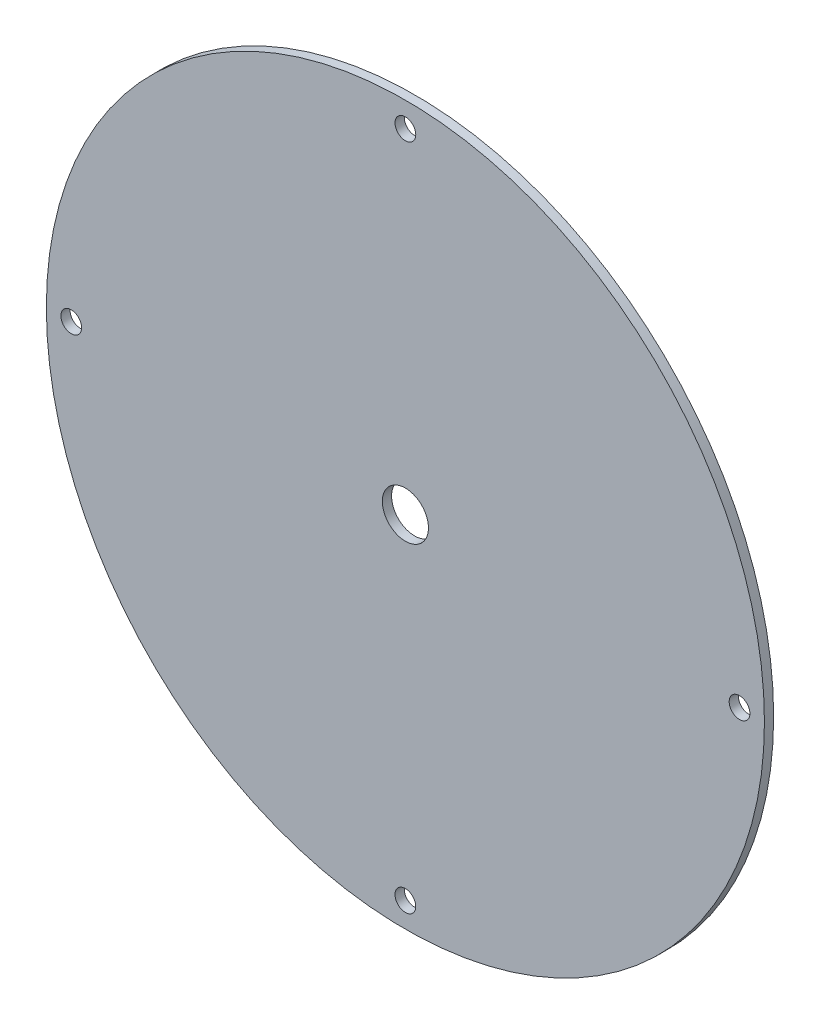
ISO-10303-21;
HEADER;
FILE_DESCRIPTION(('STEP AP214'),'2;1');
FILE_NAME('part.step','',(''),(''),'','','');
FILE_SCHEMA(('AUTOMOTIVE_DESIGN { 1 0 10303 214 1 1 1 1 }'));
ENDSEC;
DATA;
#1=APPLICATION_CONTEXT('core data for automotive mechanical design processes');
#2=APPLICATION_PROTOCOL_DEFINITION('international standard','automotive_design',2000,#1);
#3=PRODUCT_CONTEXT('',#1,'mechanical');
#4=PRODUCT('Part','Part','',(#3));
#5=PRODUCT_RELATED_PRODUCT_CATEGORY('part','',(#4));
#6=PRODUCT_DEFINITION_FORMATION('','',#4);
#7=PRODUCT_DEFINITION_CONTEXT('part definition',#1,'design');
#8=PRODUCT_DEFINITION('design','',#6,#7);
#9=PRODUCT_DEFINITION_SHAPE('','',#8);
#10=(LENGTH_UNIT() NAMED_UNIT(*) SI_UNIT(.MILLI.,.METRE.));
#11=(NAMED_UNIT(*) PLANE_ANGLE_UNIT() SI_UNIT($,.RADIAN.));
#12=(NAMED_UNIT(*) SI_UNIT($,.STERADIAN.) SOLID_ANGLE_UNIT());
#13=UNCERTAINTY_MEASURE_WITH_UNIT(LENGTH_MEASURE(1.E-05),#10,'distance_accuracy_value','');
#14=(GEOMETRIC_REPRESENTATION_CONTEXT(3) GLOBAL_UNCERTAINTY_ASSIGNED_CONTEXT((#13)) GLOBAL_UNIT_ASSIGNED_CONTEXT((#10,
#11,#12)) REPRESENTATION_CONTEXT('',''));
#15=CARTESIAN_POINT('',(0.,0.,0.));
#16=DIRECTION('',(0.,0.,1.));
#17=DIRECTION('',(1.,0.,0.));
#18=AXIS2_PLACEMENT_3D('',#15,#16,#17);
#19=CARTESIAN_POINT('',(0.0711207907724242,0.517607884922749,2.));
#20=DIRECTION('',(0.,0.,1.));
#21=DIRECTION('',(1.,0.,0.));
#22=AXIS2_PLACEMENT_3D('',#19,#20,#21);
#23=PLANE('',#22);
#24=CARTESIAN_POINT('',(-72.4288792092298,0.517607884925696,2.));
#25=DIRECTION('',(0.,0.,1.));
#26=DIRECTION('',(1.,0.,0.));
#27=AXIS2_PLACEMENT_3D('',#24,#25,#26);
#28=CIRCLE('',#27,2.25);
#29=CARTESIAN_POINT('',(-70.1788792092298,0.517607884925696,2.));
#30=VERTEX_POINT('',#29);
#31=EDGE_CURVE('E67',#30,#30,#28,.T.);
#32=ORIENTED_EDGE('',*,*,#31,.F.);
#33=EDGE_LOOP('',(#32));
#34=FACE_BOUND('',#33,.T.);
#35=CARTESIAN_POINT('',(72.5711207907702,0.517607884920295,2.));
#36=DIRECTION('',(0.,0.,1.));
#37=DIRECTION('',(1.,0.,0.));
#38=AXIS2_PLACEMENT_3D('',#35,#36,#37);
#39=CIRCLE('',#38,2.25);
#40=CARTESIAN_POINT('',(74.8211207907702,0.517607884920295,2.));
#41=VERTEX_POINT('',#40);
#42=EDGE_CURVE('E55',#41,#41,#39,.T.);
#43=ORIENTED_EDGE('',*,*,#42,.F.);
#44=EDGE_LOOP('',(#43));
#45=FACE_BOUND('',#44,.T.);
#46=CARTESIAN_POINT('',(0.0711207907724242,0.517607884922749,2.));
#47=DIRECTION('',(0.,0.,1.));
#48=DIRECTION('',(1.,0.,0.));
#49=AXIS2_PLACEMENT_3D('',#46,#47,#48);
#50=CIRCLE('',#49,77.9);
#51=CARTESIAN_POINT('',(77.9711207907724,0.517607884922749,2.));
#52=VERTEX_POINT('',#51);
#53=EDGE_CURVE('E10',#52,#52,#50,.T.);
#54=ORIENTED_EDGE('',*,*,#53,.T.);
#55=EDGE_LOOP('',(#54));
#56=FACE_BOUND('',#55,.T.);
#57=CARTESIAN_POINT('',(0.0711207907724082,73.0176078849227,2.));
#58=DIRECTION('',(0.,0.,1.));
#59=DIRECTION('',(1.,0.,0.));
#60=AXIS2_PLACEMENT_3D('',#57,#58,#59);
#61=CIRCLE('',#60,2.25);
#62=CARTESIAN_POINT('',(2.32112079077241,73.0176078849227,2.));
#63=VERTEX_POINT('',#62);
#64=EDGE_CURVE('E50',#63,#63,#61,.T.);
#65=ORIENTED_EDGE('',*,*,#64,.F.);
#66=EDGE_LOOP('',(#65));
#67=FACE_BOUND('',#66,.T.);
#68=CARTESIAN_POINT('',(0.0711207907674998,-71.9823921150772,2.));
#69=DIRECTION('',(0.,0.,1.));
#70=DIRECTION('',(1.,0.,0.));
#71=AXIS2_PLACEMENT_3D('',#68,#69,#70);
#72=CIRCLE('',#71,2.25);
#73=CARTESIAN_POINT('',(2.3211207907675,-71.9823921150772,2.));
#74=VERTEX_POINT('',#73);
#75=EDGE_CURVE('E61',#74,#74,#72,.T.);
#76=ORIENTED_EDGE('',*,*,#75,.F.);
#77=EDGE_LOOP('',(#76));
#78=FACE_BOUND('',#77,.T.);
#79=CARTESIAN_POINT('',(0.0711207907724242,0.517607884922749,2.));
#80=DIRECTION('',(0.,0.,1.));
#81=DIRECTION('',(1.,0.,0.));
#82=AXIS2_PLACEMENT_3D('',#79,#80,#81);
#83=CIRCLE('',#82,5.);
#84=CARTESIAN_POINT('',(5.07112079077242,0.517607884922749,2.));
#85=VERTEX_POINT('',#84);
#86=EDGE_CURVE('E73',#85,#85,#83,.T.);
#87=ORIENTED_EDGE('',*,*,#86,.F.);
#88=EDGE_LOOP('',(#87));
#89=FACE_BOUND('',#88,.T.);
#90=ADVANCED_FACE('F39',(#34,#45,#56,#67,#78,#89),#23,.T.);
#91=CARTESIAN_POINT('',(0.0711207907724242,0.517607884922749,0.));
#92=DIRECTION('',(0.,0.,1.));
#93=DIRECTION('',(1.,0.,0.));
#94=AXIS2_PLACEMENT_3D('',#91,#92,#93);
#95=PLANE('',#94);
#96=CARTESIAN_POINT('',(0.0711207907724242,0.517607884922749,0.));
#97=DIRECTION('',(0.,0.,1.));
#98=DIRECTION('',(1.,0.,0.));
#99=AXIS2_PLACEMENT_3D('',#96,#97,#98);
#100=CIRCLE('',#99,77.9);
#101=CARTESIAN_POINT('',(77.9711207907724,0.517607884922749,0.));
#102=VERTEX_POINT('',#101);
#103=EDGE_CURVE('E43',#102,#102,#100,.T.);
#104=ORIENTED_EDGE('',*,*,#103,.F.);
#105=EDGE_LOOP('',(#104));
#106=FACE_BOUND('',#105,.T.);
#107=CARTESIAN_POINT('',(0.0711207907724082,73.0176078849227,0.));
#108=DIRECTION('',(0.,0.,1.));
#109=DIRECTION('',(1.,0.,0.));
#110=AXIS2_PLACEMENT_3D('',#107,#108,#109);
#111=CIRCLE('',#110,2.25);
#112=CARTESIAN_POINT('',(2.32112079077241,73.0176078849227,0.));
#113=VERTEX_POINT('',#112);
#114=EDGE_CURVE('E52',#113,#113,#111,.T.);
#115=ORIENTED_EDGE('',*,*,#114,.T.);
#116=EDGE_LOOP('',(#115));
#117=FACE_BOUND('',#116,.T.);
#118=CARTESIAN_POINT('',(72.5711207907702,0.517607884920295,0.));
#119=DIRECTION('',(0.,0.,1.));
#120=DIRECTION('',(1.,0.,0.));
#121=AXIS2_PLACEMENT_3D('',#118,#119,#120);
#122=CIRCLE('',#121,2.25);
#123=CARTESIAN_POINT('',(74.8211207907702,0.517607884920295,0.));
#124=VERTEX_POINT('',#123);
#125=EDGE_CURVE('E58',#124,#124,#122,.T.);
#126=ORIENTED_EDGE('',*,*,#125,.T.);
#127=EDGE_LOOP('',(#126));
#128=FACE_BOUND('',#127,.T.);
#129=CARTESIAN_POINT('',(0.0711207907674998,-71.9823921150772,0.));
#130=DIRECTION('',(0.,0.,1.));
#131=DIRECTION('',(1.,0.,0.));
#132=AXIS2_PLACEMENT_3D('',#129,#130,#131);
#133=CIRCLE('',#132,2.25);
#134=CARTESIAN_POINT('',(2.3211207907675,-71.9823921150772,0.));
#135=VERTEX_POINT('',#134);
#136=EDGE_CURVE('E64',#135,#135,#133,.T.);
#137=ORIENTED_EDGE('',*,*,#136,.T.);
#138=EDGE_LOOP('',(#137));
#139=FACE_BOUND('',#138,.T.);
#140=CARTESIAN_POINT('',(-72.4288792092298,0.517607884925696,0.));
#141=DIRECTION('',(0.,0.,1.));
#142=DIRECTION('',(1.,0.,0.));
#143=AXIS2_PLACEMENT_3D('',#140,#141,#142);
#144=CIRCLE('',#143,2.25);
#145=CARTESIAN_POINT('',(-70.1788792092298,0.517607884925696,0.));
#146=VERTEX_POINT('',#145);
#147=EDGE_CURVE('E70',#146,#146,#144,.T.);
#148=ORIENTED_EDGE('',*,*,#147,.T.);
#149=EDGE_LOOP('',(#148));
#150=FACE_BOUND('',#149,.T.);
#151=CARTESIAN_POINT('',(0.0711207907724242,0.517607884922749,0.));
#152=DIRECTION('',(0.,0.,1.));
#153=DIRECTION('',(1.,0.,0.));
#154=AXIS2_PLACEMENT_3D('',#151,#152,#153);
#155=CIRCLE('',#154,5.);
#156=CARTESIAN_POINT('',(5.07112079077242,0.517607884922749,0.));
#157=VERTEX_POINT('',#156);
#158=EDGE_CURVE('E76',#157,#157,#155,.T.);
#159=ORIENTED_EDGE('',*,*,#158,.T.);
#160=EDGE_LOOP('',(#159));
#161=FACE_BOUND('',#160,.T.);
#162=ADVANCED_FACE('F86',(#106,#117,#128,#139,#150,#161),#95,.F.);
#163=CARTESIAN_POINT('',(0.0711207907724242,0.517607884922749,2.));
#164=DIRECTION('',(0.,0.,-1.));
#165=DIRECTION('',(-1.,0.,0.));
#166=AXIS2_PLACEMENT_3D('',#163,#164,#165);
#167=CYLINDRICAL_SURFACE('',#166,77.9);
#168=ORIENTED_EDGE('',*,*,#53,.F.);
#169=EDGE_LOOP('',(#168));
#170=FACE_BOUND('',#169,.T.);
#171=ORIENTED_EDGE('',*,*,#103,.T.);
#172=EDGE_LOOP('',(#171));
#173=FACE_BOUND('',#172,.T.);
#174=ADVANCED_FACE('F41',(#170,#173),#167,.T.);
#175=CARTESIAN_POINT('',(0.0711207907724082,73.0176078849227,2.));
#176=DIRECTION('',(0.,0.,-1.));
#177=DIRECTION('',(-1.,0.,0.));
#178=AXIS2_PLACEMENT_3D('',#175,#176,#177);
#179=CYLINDRICAL_SURFACE('',#178,2.25);
#180=ORIENTED_EDGE('',*,*,#64,.T.);
#181=EDGE_LOOP('',(#180));
#182=FACE_BOUND('',#181,.T.);
#183=ORIENTED_EDGE('',*,*,#114,.F.);
#184=EDGE_LOOP('',(#183));
#185=FACE_BOUND('',#184,.T.);
#186=ADVANCED_FACE('F96',(#182,#185),#179,.F.);
#187=CARTESIAN_POINT('',(72.5711207907702,0.517607884920295,2.));
#188=DIRECTION('',(0.,0.,-1.));
#189=DIRECTION('',(-1.,0.,0.));
#190=AXIS2_PLACEMENT_3D('',#187,#188,#189);
#191=CYLINDRICAL_SURFACE('',#190,2.25);
#192=ORIENTED_EDGE('',*,*,#42,.T.);
#193=EDGE_LOOP('',(#192));
#194=FACE_BOUND('',#193,.T.);
#195=ORIENTED_EDGE('',*,*,#125,.F.);
#196=EDGE_LOOP('',(#195));
#197=FACE_BOUND('',#196,.T.);
#198=ADVANCED_FACE('F99',(#194,#197),#191,.F.);
#199=CARTESIAN_POINT('',(0.0711207907674998,-71.9823921150772,2.));
#200=DIRECTION('',(0.,0.,-1.));
#201=DIRECTION('',(-1.,0.,0.));
#202=AXIS2_PLACEMENT_3D('',#199,#200,#201);
#203=CYLINDRICAL_SURFACE('',#202,2.25);
#204=ORIENTED_EDGE('',*,*,#75,.T.);
#205=EDGE_LOOP('',(#204));
#206=FACE_BOUND('',#205,.T.);
#207=ORIENTED_EDGE('',*,*,#136,.F.);
#208=EDGE_LOOP('',(#207));
#209=FACE_BOUND('',#208,.T.);
#210=ADVANCED_FACE('F103',(#206,#209),#203,.F.);
#211=CARTESIAN_POINT('',(-72.4288792092298,0.517607884925696,2.));
#212=DIRECTION('',(0.,0.,-1.));
#213=DIRECTION('',(-1.,0.,0.));
#214=AXIS2_PLACEMENT_3D('',#211,#212,#213);
#215=CYLINDRICAL_SURFACE('',#214,2.25);
#216=ORIENTED_EDGE('',*,*,#31,.T.);
#217=EDGE_LOOP('',(#216));
#218=FACE_BOUND('',#217,.T.);
#219=ORIENTED_EDGE('',*,*,#147,.F.);
#220=EDGE_LOOP('',(#219));
#221=FACE_BOUND('',#220,.T.);
#222=ADVANCED_FACE('F107',(#218,#221),#215,.F.);
#223=CARTESIAN_POINT('',(0.0711207907724242,0.517607884922749,2.));
#224=DIRECTION('',(0.,0.,-1.));
#225=DIRECTION('',(-1.,0.,0.));
#226=AXIS2_PLACEMENT_3D('',#223,#224,#225);
#227=CYLINDRICAL_SURFACE('',#226,5.);
#228=ORIENTED_EDGE('',*,*,#86,.T.);
#229=EDGE_LOOP('',(#228));
#230=FACE_BOUND('',#229,.T.);
#231=ORIENTED_EDGE('',*,*,#158,.F.);
#232=EDGE_LOOP('',(#231));
#233=FACE_BOUND('',#232,.T.);
#234=ADVANCED_FACE('F82',(#230,#233),#227,.F.);
#235=CLOSED_SHELL('',(#90,#162,#174,#186,#198,#210,#222,#234));
#236=MANIFOLD_SOLID_BREP('B2',#235);
#237=ADVANCED_BREP_SHAPE_REPRESENTATION('',(#18,#236),#14);
#238=SHAPE_DEFINITION_REPRESENTATION(#9,#237);
ENDSEC;
END-ISO-10303-21;
